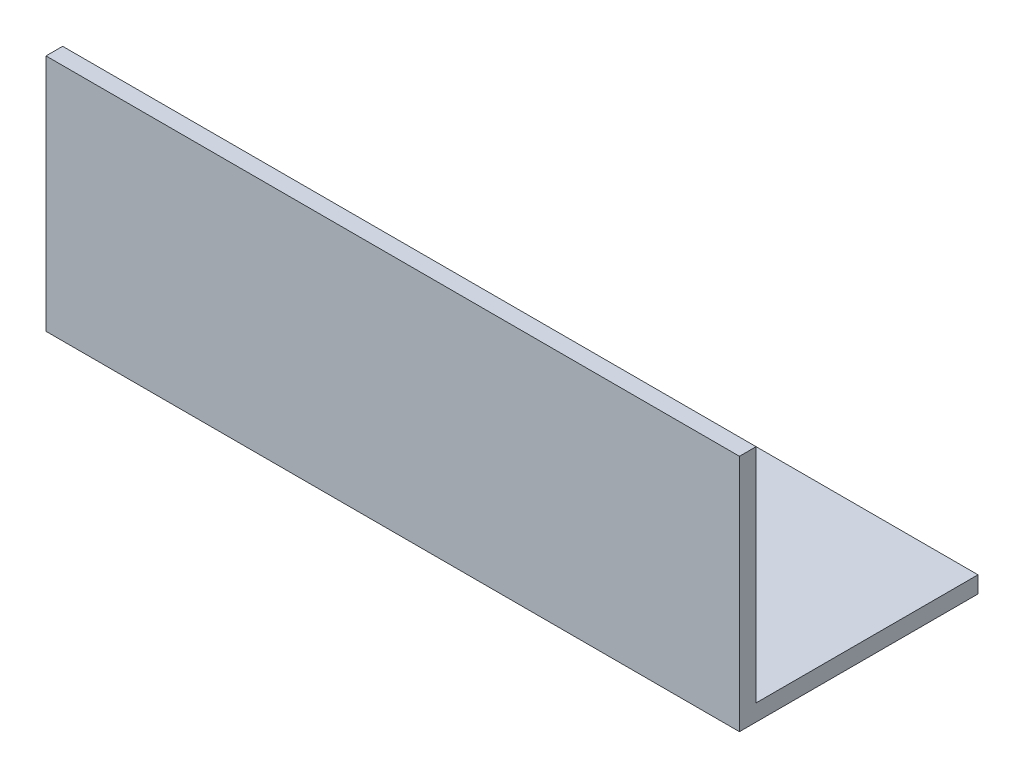
ISO-10303-21;
HEADER;
FILE_DESCRIPTION(('STEP AP214'),'2;1');
FILE_NAME('part.step','',(''),(''),'','','');
FILE_SCHEMA(('AUTOMOTIVE_DESIGN { 1 0 10303 214 1 1 1 1 }'));
ENDSEC;
DATA;
#1=APPLICATION_CONTEXT('core data for automotive mechanical design processes');
#2=APPLICATION_PROTOCOL_DEFINITION('international standard','automotive_design',2000,#1);
#3=PRODUCT_CONTEXT('',#1,'mechanical');
#4=PRODUCT('Part','Part','',(#3));
#5=PRODUCT_RELATED_PRODUCT_CATEGORY('part','',(#4));
#6=PRODUCT_DEFINITION_FORMATION('','',#4);
#7=PRODUCT_DEFINITION_CONTEXT('part definition',#1,'design');
#8=PRODUCT_DEFINITION('design','',#6,#7);
#9=PRODUCT_DEFINITION_SHAPE('','',#8);
#10=(LENGTH_UNIT() NAMED_UNIT(*) SI_UNIT(.MILLI.,.METRE.));
#11=(NAMED_UNIT(*) PLANE_ANGLE_UNIT() SI_UNIT($,.RADIAN.));
#12=(NAMED_UNIT(*) SI_UNIT($,.STERADIAN.) SOLID_ANGLE_UNIT());
#13=UNCERTAINTY_MEASURE_WITH_UNIT(LENGTH_MEASURE(1.E-05),#10,'distance_accuracy_value','');
#14=(GEOMETRIC_REPRESENTATION_CONTEXT(3) GLOBAL_UNCERTAINTY_ASSIGNED_CONTEXT((#13)) GLOBAL_UNIT_ASSIGNED_CONTEXT((#10,
#11,#12)) REPRESENTATION_CONTEXT('',''));
#15=CARTESIAN_POINT('',(0.,0.,0.));
#16=DIRECTION('',(0.,0.,1.));
#17=DIRECTION('',(1.,0.,0.));
#18=AXIS2_PLACEMENT_3D('',#15,#16,#17);
#19=CARTESIAN_POINT('',(125.,-3.,0.));
#20=DIRECTION('',(0.,1.,0.));
#21=DIRECTION('',(0.,0.,1.));
#22=AXIS2_PLACEMENT_3D('',#19,#20,#21);
#23=PLANE('',#22);
#24=DIRECTION('',(0.,0.,-1.));
#25=VECTOR('',#24,1.);
#26=CARTESIAN_POINT('',(0.,-3.,0.));
#27=LINE('',#26,#25);
#28=CARTESIAN_POINT('',(0.,-3.,3.00000000000001));
#29=VERTEX_POINT('',#28);
#30=CARTESIAN_POINT('',(0.,-3.,-40.));
#31=VERTEX_POINT('',#30);
#32=EDGE_CURVE('E114',#29,#31,#27,.T.);
#33=ORIENTED_EDGE('',*,*,#32,.T.);
#34=DIRECTION('',(-1.,0.,0.));
#35=VECTOR('',#34,1.);
#36=CARTESIAN_POINT('',(125.,-3.,-40.));
#37=LINE('',#36,#35);
#38=CARTESIAN_POINT('',(125.,-3.,-40.));
#39=VERTEX_POINT('',#38);
#40=EDGE_CURVE('E11',#39,#31,#37,.T.);
#41=ORIENTED_EDGE('',*,*,#40,.F.);
#42=DIRECTION('',(0.,0.,-1.));
#43=VECTOR('',#42,1.);
#44=CARTESIAN_POINT('',(125.,-3.,0.));
#45=LINE('',#44,#43);
#46=CARTESIAN_POINT('',(125.,-3.,3.00000000000001));
#47=VERTEX_POINT('',#46);
#48=EDGE_CURVE('E79',#47,#39,#45,.T.);
#49=ORIENTED_EDGE('',*,*,#48,.F.);
#50=DIRECTION('',(-1.,0.,0.));
#51=VECTOR('',#50,1.);
#52=CARTESIAN_POINT('',(125.,-3.,3.00000000000001));
#53=LINE('',#52,#51);
#54=EDGE_CURVE('E110',#47,#29,#53,.T.);
#55=ORIENTED_EDGE('',*,*,#54,.T.);
#56=EDGE_LOOP('',(#33,#41,#49,#55));
#57=FACE_BOUND('',#56,.T.);
#58=ADVANCED_FACE('F33',(#57),#23,.F.);
#59=CARTESIAN_POINT('',(125.,0.,-40.));
#60=DIRECTION('',(0.,0.,-1.));
#61=DIRECTION('',(-1.,0.,0.));
#62=AXIS2_PLACEMENT_3D('',#59,#60,#61);
#63=PLANE('',#62);
#64=DIRECTION('',(0.,-1.,0.));
#65=VECTOR('',#64,1.);
#66=CARTESIAN_POINT('',(0.,0.,-40.));
#67=LINE('',#66,#65);
#68=CARTESIAN_POINT('',(0.,0.,-40.));
#69=VERTEX_POINT('',#68);
#70=EDGE_CURVE('E117',#69,#31,#67,.T.);
#71=ORIENTED_EDGE('',*,*,#70,.F.);
#72=DIRECTION('',(-1.,0.,0.));
#73=VECTOR('',#72,1.);
#74=CARTESIAN_POINT('',(125.,0.,-40.));
#75=LINE('',#74,#73);
#76=CARTESIAN_POINT('',(125.,0.,-40.));
#77=VERTEX_POINT('',#76);
#78=EDGE_CURVE('E41',#77,#69,#75,.T.);
#79=ORIENTED_EDGE('',*,*,#78,.F.);
#80=DIRECTION('',(0.,-1.,0.));
#81=VECTOR('',#80,1.);
#82=CARTESIAN_POINT('',(125.,0.,-40.));
#83=LINE('',#82,#81);
#84=EDGE_CURVE('E203',#77,#39,#83,.T.);
#85=ORIENTED_EDGE('',*,*,#84,.T.);
#86=ORIENTED_EDGE('',*,*,#40,.T.);
#87=EDGE_LOOP('',(#71,#79,#85,#86));
#88=FACE_BOUND('',#87,.T.);
#89=ADVANCED_FACE('F135',(#88),#63,.T.);
#90=CARTESIAN_POINT('',(125.,0.,0.));
#91=DIRECTION('',(0.,1.,0.));
#92=DIRECTION('',(0.,0.,1.));
#93=AXIS2_PLACEMENT_3D('',#90,#91,#92);
#94=PLANE('',#93);
#95=DIRECTION('',(0.,0.,-1.));
#96=VECTOR('',#95,1.);
#97=CARTESIAN_POINT('',(0.,0.,0.));
#98=LINE('',#97,#96);
#99=CARTESIAN_POINT('',(0.,0.,0.));
#100=VERTEX_POINT('',#99);
#101=EDGE_CURVE('E120',#100,#69,#98,.T.);
#102=ORIENTED_EDGE('',*,*,#101,.F.);
#103=DIRECTION('',(-1.,0.,0.));
#104=VECTOR('',#103,1.);
#105=CARTESIAN_POINT('',(125.,0.,0.));
#106=LINE('',#105,#104);
#107=CARTESIAN_POINT('',(125.,0.,0.));
#108=VERTEX_POINT('',#107);
#109=EDGE_CURVE('E100',#108,#100,#106,.T.);
#110=ORIENTED_EDGE('',*,*,#109,.F.);
#111=DIRECTION('',(0.,0.,-1.));
#112=VECTOR('',#111,1.);
#113=CARTESIAN_POINT('',(125.,0.,0.));
#114=LINE('',#113,#112);
#115=EDGE_CURVE('E106',#108,#77,#114,.T.);
#116=ORIENTED_EDGE('',*,*,#115,.T.);
#117=ORIENTED_EDGE('',*,*,#78,.T.);
#118=EDGE_LOOP('',(#102,#110,#116,#117));
#119=FACE_BOUND('',#118,.T.);
#120=ADVANCED_FACE('F132',(#119),#94,.T.);
#121=CARTESIAN_POINT('',(125.,40.,-1.19525527596782E-13));
#122=DIRECTION('',(0.,0.,-1.));
#123=DIRECTION('',(0.,1.,0.));
#124=AXIS2_PLACEMENT_3D('',#121,#122,#123);
#125=PLANE('',#124);
#126=DIRECTION('',(0.,-1.,0.));
#127=VECTOR('',#126,1.);
#128=CARTESIAN_POINT('',(0.,40.,-1.19525527596782E-13));
#129=LINE('',#128,#127);
#130=CARTESIAN_POINT('',(0.,40.,-1.19525527596782E-13));
#131=VERTEX_POINT('',#130);
#132=EDGE_CURVE('E95',#131,#100,#129,.T.);
#133=ORIENTED_EDGE('',*,*,#132,.F.);
#134=DIRECTION('',(-1.,0.,0.));
#135=VECTOR('',#134,1.);
#136=CARTESIAN_POINT('',(125.,40.,-1.19525527596782E-13));
#137=LINE('',#136,#135);
#138=CARTESIAN_POINT('',(125.,40.,-1.19525527596782E-13));
#139=VERTEX_POINT('',#138);
#140=EDGE_CURVE('E90',#139,#131,#137,.T.);
#141=ORIENTED_EDGE('',*,*,#140,.F.);
#142=DIRECTION('',(0.,-1.,0.));
#143=VECTOR('',#142,1.);
#144=CARTESIAN_POINT('',(125.,40.,-1.19525527596782E-13));
#145=LINE('',#144,#143);
#146=EDGE_CURVE('E93',#139,#108,#145,.T.);
#147=ORIENTED_EDGE('',*,*,#146,.T.);
#148=ORIENTED_EDGE('',*,*,#109,.T.);
#149=EDGE_LOOP('',(#133,#141,#147,#148));
#150=FACE_BOUND('',#149,.T.);
#151=ADVANCED_FACE('F92',(#150),#125,.T.);
#152=CARTESIAN_POINT('',(125.,40.,2.99999999999988));
#153=DIRECTION('',(0.,1.,0.));
#154=DIRECTION('',(0.,0.,1.));
#155=AXIS2_PLACEMENT_3D('',#152,#153,#154);
#156=PLANE('',#155);
#157=DIRECTION('',(0.,0.,-1.));
#158=VECTOR('',#157,1.);
#159=CARTESIAN_POINT('',(0.,40.,2.99999999999988));
#160=LINE('',#159,#158);
#161=CARTESIAN_POINT('',(0.,40.,2.99999999999988));
#162=VERTEX_POINT('',#161);
#163=EDGE_CURVE('E124',#162,#131,#160,.T.);
#164=ORIENTED_EDGE('',*,*,#163,.F.);
#165=DIRECTION('',(-1.,0.,0.));
#166=VECTOR('',#165,1.);
#167=CARTESIAN_POINT('',(125.,40.,2.99999999999988));
#168=LINE('',#167,#166);
#169=CARTESIAN_POINT('',(125.,40.,2.99999999999988));
#170=VERTEX_POINT('',#169);
#171=EDGE_CURVE('E70',#170,#162,#168,.T.);
#172=ORIENTED_EDGE('',*,*,#171,.F.);
#173=DIRECTION('',(0.,0.,-1.));
#174=VECTOR('',#173,1.);
#175=CARTESIAN_POINT('',(125.,40.,2.99999999999988));
#176=LINE('',#175,#174);
#177=EDGE_CURVE('E104',#170,#139,#176,.T.);
#178=ORIENTED_EDGE('',*,*,#177,.T.);
#179=ORIENTED_EDGE('',*,*,#140,.T.);
#180=EDGE_LOOP('',(#164,#172,#178,#179));
#181=FACE_BOUND('',#180,.T.);
#182=ADVANCED_FACE('F108',(#181),#156,.T.);
#183=CARTESIAN_POINT('',(125.,40.,2.99999999999988));
#184=DIRECTION('',(0.,0.,-1.));
#185=DIRECTION('',(0.,1.,0.));
#186=AXIS2_PLACEMENT_3D('',#183,#184,#185);
#187=PLANE('',#186);
#188=DIRECTION('',(0.,-1.,0.));
#189=VECTOR('',#188,1.);
#190=CARTESIAN_POINT('',(0.,40.,2.99999999999988));
#191=LINE('',#190,#189);
#192=EDGE_CURVE('E73',#162,#29,#191,.T.);
#193=ORIENTED_EDGE('',*,*,#192,.T.);
#194=ORIENTED_EDGE('',*,*,#54,.F.);
#195=DIRECTION('',(0.,-1.,0.));
#196=VECTOR('',#195,1.);
#197=CARTESIAN_POINT('',(125.,40.,2.99999999999988));
#198=LINE('',#197,#196);
#199=EDGE_CURVE('E49',#170,#47,#198,.T.);
#200=ORIENTED_EDGE('',*,*,#199,.F.);
#201=ORIENTED_EDGE('',*,*,#171,.T.);
#202=EDGE_LOOP('',(#193,#194,#200,#201));
#203=FACE_BOUND('',#202,.T.);
#204=ADVANCED_FACE('F140',(#203),#187,.F.);
#205=CARTESIAN_POINT('',(125.,0.,0.));
#206=DIRECTION('',(-1.,0.,0.));
#207=DIRECTION('',(0.,0.,1.));
#208=AXIS2_PLACEMENT_3D('',#205,#206,#207);
#209=PLANE('',#208);
#210=ORIENTED_EDGE('',*,*,#48,.T.);
#211=ORIENTED_EDGE('',*,*,#84,.F.);
#212=ORIENTED_EDGE('',*,*,#115,.F.);
#213=ORIENTED_EDGE('',*,*,#146,.F.);
#214=ORIENTED_EDGE('',*,*,#177,.F.);
#215=ORIENTED_EDGE('',*,*,#199,.T.);
#216=EDGE_LOOP('',(#210,#211,#212,#213,#214,#215));
#217=FACE_BOUND('',#216,.T.);
#218=ADVANCED_FACE('F103',(#217),#209,.F.);
#219=CARTESIAN_POINT('',(0.,0.,0.));
#220=DIRECTION('',(-1.,0.,0.));
#221=DIRECTION('',(0.,0.,1.));
#222=AXIS2_PLACEMENT_3D('',#219,#220,#221);
#223=PLANE('',#222);
#224=ORIENTED_EDGE('',*,*,#32,.F.);
#225=ORIENTED_EDGE('',*,*,#192,.F.);
#226=ORIENTED_EDGE('',*,*,#163,.T.);
#227=ORIENTED_EDGE('',*,*,#132,.T.);
#228=ORIENTED_EDGE('',*,*,#101,.T.);
#229=ORIENTED_EDGE('',*,*,#70,.T.);
#230=EDGE_LOOP('',(#224,#225,#226,#227,#228,#229));
#231=FACE_BOUND('',#230,.T.);
#232=ADVANCED_FACE('F138',(#231),#223,.T.);
#233=CLOSED_SHELL('',(#58,#89,#120,#151,#182,#204,#218,#232));
#234=MANIFOLD_SOLID_BREP('B2',#233);
#235=ADVANCED_BREP_SHAPE_REPRESENTATION('',(#18,#234),#14);
#236=SHAPE_DEFINITION_REPRESENTATION(#9,#235);
ENDSEC;
END-ISO-10303-21;
